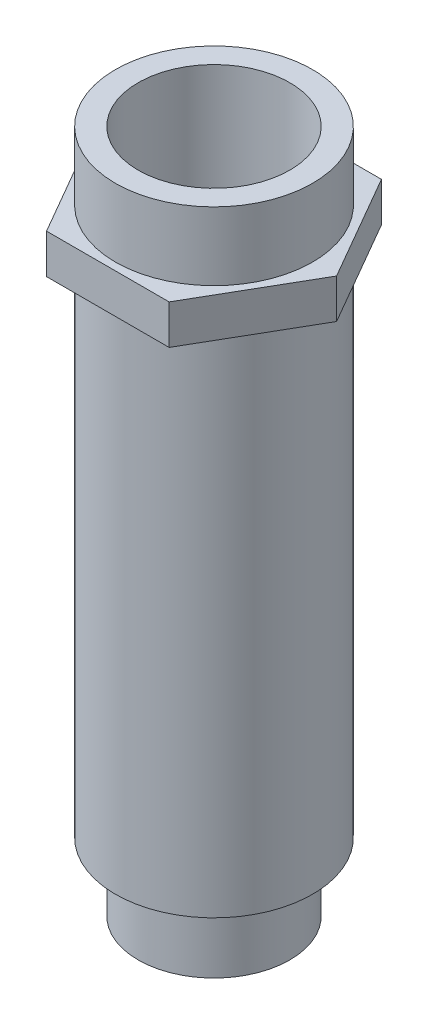
ISO-10303-21;
HEADER;
FILE_DESCRIPTION(('STEP AP214'),'2;1');
FILE_NAME('part.step','',(''),(''),'','','');
FILE_SCHEMA(('AUTOMOTIVE_DESIGN { 1 0 10303 214 1 1 1 1 }'));
ENDSEC;
DATA;
#1=APPLICATION_CONTEXT('core data for automotive mechanical design processes');
#2=APPLICATION_PROTOCOL_DEFINITION('international standard','automotive_design',2000,#1);
#3=PRODUCT_CONTEXT('',#1,'mechanical');
#4=PRODUCT('Part','Part','',(#3));
#5=PRODUCT_RELATED_PRODUCT_CATEGORY('part','',(#4));
#6=PRODUCT_DEFINITION_FORMATION('','',#4);
#7=PRODUCT_DEFINITION_CONTEXT('part definition',#1,'design');
#8=PRODUCT_DEFINITION('design','',#6,#7);
#9=PRODUCT_DEFINITION_SHAPE('','',#8);
#10=(LENGTH_UNIT() NAMED_UNIT(*) SI_UNIT(.MILLI.,.METRE.));
#11=(NAMED_UNIT(*) PLANE_ANGLE_UNIT() SI_UNIT($,.RADIAN.));
#12=(NAMED_UNIT(*) SI_UNIT($,.STERADIAN.) SOLID_ANGLE_UNIT());
#13=UNCERTAINTY_MEASURE_WITH_UNIT(LENGTH_MEASURE(1.E-05),#10,'distance_accuracy_value','');
#14=(GEOMETRIC_REPRESENTATION_CONTEXT(3) GLOBAL_UNCERTAINTY_ASSIGNED_CONTEXT((#13)) GLOBAL_UNIT_ASSIGNED_CONTEXT((#10,
#11,#12)) REPRESENTATION_CONTEXT('',''));
#15=CARTESIAN_POINT('',(0.,0.,0.));
#16=DIRECTION('',(0.,0.,1.));
#17=DIRECTION('',(1.,0.,0.));
#18=AXIS2_PLACEMENT_3D('',#15,#16,#17);
#19=CARTESIAN_POINT('',(6.5,0.,0.));
#20=DIRECTION('',(0.,1.,0.));
#21=DIRECTION('',(-1.,0.,0.));
#22=AXIS2_PLACEMENT_3D('',#19,#20,#21);
#23=PLANE('',#22);
#24=CARTESIAN_POINT('',(0.,0.,0.));
#25=DIRECTION('',(0.,1.,0.));
#26=DIRECTION('',(-1.,0.,0.));
#27=AXIS2_PLACEMENT_3D('',#24,#25,#26);
#28=CIRCLE('',#27,6.5);
#29=CARTESIAN_POINT('',(-6.5,0.,0.));
#30=VERTEX_POINT('',#29);
#31=EDGE_CURVE('E126',#30,#30,#28,.T.);
#32=ORIENTED_EDGE('',*,*,#31,.F.);
#33=EDGE_LOOP('',(#32));
#34=FACE_BOUND('',#33,.T.);
#35=CARTESIAN_POINT('',(0.,0.,0.));
#36=DIRECTION('',(0.,1.,0.));
#37=DIRECTION('',(-1.,0.,0.));
#38=AXIS2_PLACEMENT_3D('',#35,#36,#37);
#39=CIRCLE('',#38,5.);
#40=CARTESIAN_POINT('',(-5.,0.,0.));
#41=VERTEX_POINT('',#40);
#42=EDGE_CURVE('E12',#41,#41,#39,.F.);
#43=ORIENTED_EDGE('',*,*,#42,.F.);
#44=EDGE_LOOP('',(#43));
#45=FACE_BOUND('',#44,.T.);
#46=ADVANCED_FACE('F18',(#34,#45),#23,.F.);
#47=CARTESIAN_POINT('',(8.08290376865476,36.1,0.));
#48=DIRECTION('',(0.,1.,0.));
#49=DIRECTION('',(0.,0.,1.));
#50=AXIS2_PLACEMENT_3D('',#47,#48,#49);
#51=PLANE('',#50);
#52=DIRECTION('',(0.5,0.,-0.866025403784439));
#53=VECTOR('',#52,1.);
#54=CARTESIAN_POINT('',(4.04145188432738,36.1,7.));
#55=LINE('',#54,#53);
#56=CARTESIAN_POINT('',(4.04145188432738,36.1,7.));
#57=VERTEX_POINT('',#56);
#58=CARTESIAN_POINT('',(8.08290376865476,36.1,0.));
#59=VERTEX_POINT('',#58);
#60=EDGE_CURVE('E117',#57,#59,#55,.T.);
#61=ORIENTED_EDGE('',*,*,#60,.T.);
#62=DIRECTION('',(-0.5,0.,-0.866025403784439));
#63=VECTOR('',#62,1.);
#64=CARTESIAN_POINT('',(8.08290376865476,36.1,0.));
#65=LINE('',#64,#63);
#66=CARTESIAN_POINT('',(4.04145188432737,36.1,-7.));
#67=VERTEX_POINT('',#66);
#68=EDGE_CURVE('E74',#59,#67,#65,.T.);
#69=ORIENTED_EDGE('',*,*,#68,.T.);
#70=DIRECTION('',(-1.,0.,0.));
#71=VECTOR('',#70,1.);
#72=CARTESIAN_POINT('',(4.04145188432737,36.1,-7.));
#73=LINE('',#72,#71);
#74=CARTESIAN_POINT('',(-4.04145188432739,36.1,-7.));
#75=VERTEX_POINT('',#74);
#76=EDGE_CURVE('E88',#67,#75,#73,.T.);
#77=ORIENTED_EDGE('',*,*,#76,.T.);
#78=DIRECTION('',(-0.5,0.,0.866025403784439));
#79=VECTOR('',#78,1.);
#80=CARTESIAN_POINT('',(-4.04145188432739,36.1,-7.));
#81=LINE('',#80,#79);
#82=CARTESIAN_POINT('',(-8.08290376865477,36.1,0.));
#83=VERTEX_POINT('',#82);
#84=EDGE_CURVE('E81',#75,#83,#81,.T.);
#85=ORIENTED_EDGE('',*,*,#84,.T.);
#86=DIRECTION('',(0.5,0.,0.866025403784439));
#87=VECTOR('',#86,1.);
#88=CARTESIAN_POINT('',(-8.08290376865477,36.1,0.));
#89=LINE('',#88,#87);
#90=CARTESIAN_POINT('',(-4.04145188432739,36.1,7.));
#91=VERTEX_POINT('',#90);
#92=EDGE_CURVE('E86',#83,#91,#89,.T.);
#93=ORIENTED_EDGE('',*,*,#92,.T.);
#94=DIRECTION('',(1.,0.,0.));
#95=VECTOR('',#94,1.);
#96=CARTESIAN_POINT('',(-4.04145188432739,36.1,7.));
#97=LINE('',#96,#95);
#98=EDGE_CURVE('E36',#91,#57,#97,.T.);
#99=ORIENTED_EDGE('',*,*,#98,.T.);
#100=EDGE_LOOP('',(#61,#69,#77,#85,#93,#99));
#101=FACE_BOUND('',#100,.T.);
#102=CARTESIAN_POINT('',(0.,36.1,0.));
#103=DIRECTION('',(0.,1.,0.));
#104=DIRECTION('',(0.,0.,1.));
#105=AXIS2_PLACEMENT_3D('',#102,#103,#104);
#106=CIRCLE('',#105,6.5);
#107=CARTESIAN_POINT('',(0.,36.1,6.5));
#108=VERTEX_POINT('',#107);
#109=EDGE_CURVE('E196',#108,#108,#106,.T.);
#110=ORIENTED_EDGE('',*,*,#109,.F.);
#111=EDGE_LOOP('',(#110));
#112=FACE_BOUND('',#111,.T.);
#113=ADVANCED_FACE('F83',(#101,#112),#51,.T.);
#114=CARTESIAN_POINT('',(0.,33.5,0.));
#115=DIRECTION('',(0.,1.,0.));
#116=DIRECTION('',(-1.,0.,0.));
#117=AXIS2_PLACEMENT_3D('',#114,#115,#116);
#118=CYLINDRICAL_SURFACE('',#117,6.5);
#119=CARTESIAN_POINT('',(0.,33.5,0.));
#120=DIRECTION('',(0.,1.,0.));
#121=DIRECTION('',(-1.,0.,0.));
#122=AXIS2_PLACEMENT_3D('',#119,#120,#121);
#123=CIRCLE('',#122,6.5);
#124=CARTESIAN_POINT('',(-6.50000000000001,33.5,0.));
#125=VERTEX_POINT('',#124);
#126=EDGE_CURVE('E28',#125,#125,#123,.T.);
#127=ORIENTED_EDGE('',*,*,#126,.F.);
#128=EDGE_LOOP('',(#127));
#129=FACE_BOUND('',#128,.T.);
#130=ORIENTED_EDGE('',*,*,#31,.T.);
#131=EDGE_LOOP('',(#130));
#132=FACE_BOUND('',#131,.T.);
#133=ADVANCED_FACE('F20',(#129,#132),#118,.T.);
#134=CARTESIAN_POINT('',(8.08290376865476,33.5,0.));
#135=DIRECTION('',(0.,1.,0.));
#136=DIRECTION('',(0.,0.,1.));
#137=AXIS2_PLACEMENT_3D('',#134,#135,#136);
#138=PLANE('',#137);
#139=DIRECTION('',(0.5,0.,-0.866025403784439));
#140=VECTOR('',#139,1.);
#141=CARTESIAN_POINT('',(4.04145188432738,33.5,7.));
#142=LINE('',#141,#140);
#143=CARTESIAN_POINT('',(4.04145188432738,33.5,7.));
#144=VERTEX_POINT('',#143);
#145=CARTESIAN_POINT('',(8.08290376865476,33.5,0.));
#146=VERTEX_POINT('',#145);
#147=EDGE_CURVE('E106',#144,#146,#142,.T.);
#148=ORIENTED_EDGE('',*,*,#147,.F.);
#149=DIRECTION('',(1.,0.,0.));
#150=VECTOR('',#149,1.);
#151=CARTESIAN_POINT('',(-4.04145188432739,33.5,7.));
#152=LINE('',#151,#150);
#153=CARTESIAN_POINT('',(-4.04145188432739,33.5,7.));
#154=VERTEX_POINT('',#153);
#155=EDGE_CURVE('E65',#154,#144,#152,.T.);
#156=ORIENTED_EDGE('',*,*,#155,.F.);
#157=DIRECTION('',(0.5,0.,0.866025403784439));
#158=VECTOR('',#157,1.);
#159=CARTESIAN_POINT('',(-8.08290376865477,33.5,0.));
#160=LINE('',#159,#158);
#161=CARTESIAN_POINT('',(-8.08290376865477,33.5,0.));
#162=VERTEX_POINT('',#161);
#163=EDGE_CURVE('E59',#162,#154,#160,.T.);
#164=ORIENTED_EDGE('',*,*,#163,.F.);
#165=DIRECTION('',(-0.5,0.,0.866025403784439));
#166=VECTOR('',#165,1.);
#167=CARTESIAN_POINT('',(-4.04145188432739,33.5,-7.));
#168=LINE('',#167,#166);
#169=CARTESIAN_POINT('',(-4.04145188432739,33.5,-7.));
#170=VERTEX_POINT('',#169);
#171=EDGE_CURVE('E96',#170,#162,#168,.T.);
#172=ORIENTED_EDGE('',*,*,#171,.F.);
#173=DIRECTION('',(-1.,0.,0.));
#174=VECTOR('',#173,1.);
#175=CARTESIAN_POINT('',(4.04145188432737,33.5,-7.));
#176=LINE('',#175,#174);
#177=CARTESIAN_POINT('',(4.04145188432737,33.5,-7.));
#178=VERTEX_POINT('',#177);
#179=EDGE_CURVE('E112',#178,#170,#176,.T.);
#180=ORIENTED_EDGE('',*,*,#179,.F.);
#181=DIRECTION('',(-0.5,0.,-0.866025403784439));
#182=VECTOR('',#181,1.);
#183=CARTESIAN_POINT('',(8.08290376865476,33.5,0.));
#184=LINE('',#183,#182);
#185=EDGE_CURVE('E109',#146,#178,#184,.T.);
#186=ORIENTED_EDGE('',*,*,#185,.F.);
#187=EDGE_LOOP('',(#148,#156,#164,#172,#180,#186));
#188=FACE_BOUND('',#187,.T.);
#189=ORIENTED_EDGE('',*,*,#126,.T.);
#190=EDGE_LOOP('',(#189));
#191=FACE_BOUND('',#190,.T.);
#192=ADVANCED_FACE('F132',(#188,#191),#138,.F.);
#193=CARTESIAN_POINT('',(4.04145188432738,36.1,7.));
#194=DIRECTION('',(-0.866025403784439,0.,-0.5));
#195=DIRECTION('',(-0.5,0.,0.866025403784439));
#196=AXIS2_PLACEMENT_3D('',#193,#194,#195);
#197=PLANE('',#196);
#198=ORIENTED_EDGE('',*,*,#147,.T.);
#199=DIRECTION('',(0.,-1.,0.));
#200=VECTOR('',#199,1.);
#201=CARTESIAN_POINT('',(8.08290376865476,36.1,0.));
#202=LINE('',#201,#200);
#203=EDGE_CURVE('E124',#59,#146,#202,.T.);
#204=ORIENTED_EDGE('',*,*,#203,.F.);
#205=ORIENTED_EDGE('',*,*,#60,.F.);
#206=DIRECTION('',(0.,-1.,0.));
#207=VECTOR('',#206,1.);
#208=CARTESIAN_POINT('',(4.04145188432738,36.1,7.));
#209=LINE('',#208,#207);
#210=EDGE_CURVE('E102',#57,#144,#209,.T.);
#211=ORIENTED_EDGE('',*,*,#210,.T.);
#212=EDGE_LOOP('',(#198,#204,#205,#211));
#213=FACE_BOUND('',#212,.T.);
#214=ADVANCED_FACE('F170',(#213),#197,.F.);
#215=CARTESIAN_POINT('',(8.08290376865476,36.1,0.));
#216=DIRECTION('',(-0.866025403784439,0.,0.5));
#217=DIRECTION('',(0.5,0.,0.866025403784439));
#218=AXIS2_PLACEMENT_3D('',#215,#216,#217);
#219=PLANE('',#218);
#220=ORIENTED_EDGE('',*,*,#185,.T.);
#221=DIRECTION('',(0.,-1.,0.));
#222=VECTOR('',#221,1.);
#223=CARTESIAN_POINT('',(4.04145188432737,36.1,-7.));
#224=LINE('',#223,#222);
#225=EDGE_CURVE('E121',#67,#178,#224,.T.);
#226=ORIENTED_EDGE('',*,*,#225,.F.);
#227=ORIENTED_EDGE('',*,*,#68,.F.);
#228=ORIENTED_EDGE('',*,*,#203,.T.);
#229=EDGE_LOOP('',(#220,#226,#227,#228));
#230=FACE_BOUND('',#229,.T.);
#231=ADVANCED_FACE('F181',(#230),#219,.F.);
#232=CARTESIAN_POINT('',(4.04145188432737,36.1,-7.));
#233=DIRECTION('',(0.,0.,1.));
#234=DIRECTION('',(1.,0.,0.));
#235=AXIS2_PLACEMENT_3D('',#232,#233,#234);
#236=PLANE('',#235);
#237=ORIENTED_EDGE('',*,*,#179,.T.);
#238=DIRECTION('',(0.,-1.,0.));
#239=VECTOR('',#238,1.);
#240=CARTESIAN_POINT('',(-4.04145188432739,36.1,-7.));
#241=LINE('',#240,#239);
#242=EDGE_CURVE('E97',#75,#170,#241,.T.);
#243=ORIENTED_EDGE('',*,*,#242,.F.);
#244=ORIENTED_EDGE('',*,*,#76,.F.);
#245=ORIENTED_EDGE('',*,*,#225,.T.);
#246=EDGE_LOOP('',(#237,#243,#244,#245));
#247=FACE_BOUND('',#246,.T.);
#248=ADVANCED_FACE('F178',(#247),#236,.F.);
#249=CARTESIAN_POINT('',(-4.04145188432739,36.1,-7.));
#250=DIRECTION('',(0.866025403784439,0.,0.5));
#251=DIRECTION('',(0.5,0.,-0.866025403784439));
#252=AXIS2_PLACEMENT_3D('',#249,#250,#251);
#253=PLANE('',#252);
#254=ORIENTED_EDGE('',*,*,#171,.T.);
#255=DIRECTION('',(0.,-1.,0.));
#256=VECTOR('',#255,1.);
#257=CARTESIAN_POINT('',(-8.08290376865477,36.1,0.));
#258=LINE('',#257,#256);
#259=EDGE_CURVE('E93',#83,#162,#258,.T.);
#260=ORIENTED_EDGE('',*,*,#259,.F.);
#261=ORIENTED_EDGE('',*,*,#84,.F.);
#262=ORIENTED_EDGE('',*,*,#242,.T.);
#263=EDGE_LOOP('',(#254,#260,#261,#262));
#264=FACE_BOUND('',#263,.T.);
#265=ADVANCED_FACE('F94',(#264),#253,.F.);
#266=CARTESIAN_POINT('',(-8.08290376865477,36.1,0.));
#267=DIRECTION('',(0.866025403784439,0.,-0.5));
#268=DIRECTION('',(-0.5,0.,-0.866025403784439));
#269=AXIS2_PLACEMENT_3D('',#266,#267,#268);
#270=PLANE('',#269);
#271=ORIENTED_EDGE('',*,*,#163,.T.);
#272=DIRECTION('',(0.,-1.,0.));
#273=VECTOR('',#272,1.);
#274=CARTESIAN_POINT('',(-4.04145188432739,36.1,7.));
#275=LINE('',#274,#273);
#276=EDGE_CURVE('E98',#91,#154,#275,.T.);
#277=ORIENTED_EDGE('',*,*,#276,.F.);
#278=ORIENTED_EDGE('',*,*,#92,.F.);
#279=ORIENTED_EDGE('',*,*,#259,.T.);
#280=EDGE_LOOP('',(#271,#277,#278,#279));
#281=FACE_BOUND('',#280,.T.);
#282=ADVANCED_FACE('F100',(#281),#270,.F.);
#283=CARTESIAN_POINT('',(-4.04145188432739,36.1,7.));
#284=DIRECTION('',(0.,0.,-1.));
#285=DIRECTION('',(-1.,0.,0.));
#286=AXIS2_PLACEMENT_3D('',#283,#284,#285);
#287=PLANE('',#286);
#288=ORIENTED_EDGE('',*,*,#155,.T.);
#289=ORIENTED_EDGE('',*,*,#210,.F.);
#290=ORIENTED_EDGE('',*,*,#98,.F.);
#291=ORIENTED_EDGE('',*,*,#276,.T.);
#292=EDGE_LOOP('',(#288,#289,#290,#291));
#293=FACE_BOUND('',#292,.T.);
#294=ADVANCED_FACE('F164',(#293),#287,.F.);
#295=CARTESIAN_POINT('',(0.,40.6,0.));
#296=DIRECTION('',(0.,-1.,0.));
#297=DIRECTION('',(0.,0.,-1.));
#298=AXIS2_PLACEMENT_3D('',#295,#296,#297);
#299=CYLINDRICAL_SURFACE('',#298,6.5);
#300=CARTESIAN_POINT('',(0.,40.6,0.));
#301=DIRECTION('',(0.,1.,0.));
#302=DIRECTION('',(0.,0.,1.));
#303=AXIS2_PLACEMENT_3D('',#300,#301,#302);
#304=CIRCLE('',#303,6.5);
#305=CARTESIAN_POINT('',(0.,40.6,6.5));
#306=VERTEX_POINT('',#305);
#307=EDGE_CURVE('E110',#306,#306,#304,.T.);
#308=ORIENTED_EDGE('',*,*,#307,.F.);
#309=EDGE_LOOP('',(#308));
#310=FACE_BOUND('',#309,.T.);
#311=ORIENTED_EDGE('',*,*,#109,.T.);
#312=EDGE_LOOP('',(#311));
#313=FACE_BOUND('',#312,.T.);
#314=ADVANCED_FACE('F156',(#310,#313),#299,.T.);
#315=CARTESIAN_POINT('',(0.,40.6,0.));
#316=DIRECTION('',(0.,1.,0.));
#317=DIRECTION('',(0.,0.,1.));
#318=AXIS2_PLACEMENT_3D('',#315,#316,#317);
#319=PLANE('',#318);
#320=CARTESIAN_POINT('',(0.,40.6,0.));
#321=DIRECTION('',(0.,1.,0.));
#322=DIRECTION('',(0.,0.,1.));
#323=AXIS2_PLACEMENT_3D('',#320,#321,#322);
#324=CIRCLE('',#323,5.);
#325=CARTESIAN_POINT('',(0.,40.6,5.));
#326=VERTEX_POINT('',#325);
#327=EDGE_CURVE('E213',#326,#326,#324,.T.);
#328=ORIENTED_EDGE('',*,*,#327,.F.);
#329=EDGE_LOOP('',(#328));
#330=FACE_BOUND('',#329,.T.);
#331=ORIENTED_EDGE('',*,*,#307,.T.);
#332=EDGE_LOOP('',(#331));
#333=FACE_BOUND('',#332,.T.);
#334=ADVANCED_FACE('F145',(#330,#333),#319,.T.);
#335=CARTESIAN_POINT('',(0.,-4.5,0.));
#336=DIRECTION('',(0.,1.,0.));
#337=DIRECTION('',(-1.,0.,0.));
#338=AXIS2_PLACEMENT_3D('',#335,#336,#337);
#339=CYLINDRICAL_SURFACE('',#338,5.);
#340=CARTESIAN_POINT('',(0.,-4.5,0.));
#341=DIRECTION('',(0.,-1.,0.));
#342=DIRECTION('',(1.,0.,0.));
#343=AXIS2_PLACEMENT_3D('',#340,#341,#342);
#344=CIRCLE('',#343,5.);
#345=CARTESIAN_POINT('',(5.,-4.5,0.));
#346=VERTEX_POINT('',#345);
#347=EDGE_CURVE('E199',#346,#346,#344,.T.);
#348=ORIENTED_EDGE('',*,*,#347,.F.);
#349=EDGE_LOOP('',(#348));
#350=FACE_BOUND('',#349,.T.);
#351=ORIENTED_EDGE('',*,*,#42,.T.);
#352=EDGE_LOOP('',(#351));
#353=FACE_BOUND('',#352,.T.);
#354=ADVANCED_FACE('F142',(#350,#353),#339,.T.);
#355=CARTESIAN_POINT('',(0.,-4.5,0.));
#356=DIRECTION('',(0.,-1.,0.));
#357=DIRECTION('',(1.,0.,0.));
#358=AXIS2_PLACEMENT_3D('',#355,#356,#357);
#359=PLANE('',#358);
#360=CARTESIAN_POINT('',(0.,-4.5,0.));
#361=DIRECTION('',(0.,-1.,0.));
#362=DIRECTION('',(1.,0.,0.));
#363=AXIS2_PLACEMENT_3D('',#360,#361,#362);
#364=CIRCLE('',#363,3.);
#365=CARTESIAN_POINT('',(3.,-4.5,0.));
#366=VERTEX_POINT('',#365);
#367=EDGE_CURVE('E205',#366,#366,#364,.T.);
#368=ORIENTED_EDGE('',*,*,#367,.F.);
#369=EDGE_LOOP('',(#368));
#370=FACE_BOUND('',#369,.T.);
#371=ORIENTED_EDGE('',*,*,#347,.T.);
#372=EDGE_LOOP('',(#371));
#373=FACE_BOUND('',#372,.T.);
#374=ADVANCED_FACE('F144',(#370,#373),#359,.T.);
#375=CARTESIAN_POINT('',(0.,-3.,0.));
#376=DIRECTION('',(0.,-1.,0.));
#377=DIRECTION('',(1.,0.,0.));
#378=AXIS2_PLACEMENT_3D('',#375,#376,#377);
#379=CYLINDRICAL_SURFACE('',#378,3.);
#380=CARTESIAN_POINT('',(0.,-3.,0.));
#381=DIRECTION('',(0.,-1.,0.));
#382=DIRECTION('',(1.,0.,0.));
#383=AXIS2_PLACEMENT_3D('',#380,#381,#382);
#384=CIRCLE('',#383,3.);
#385=CARTESIAN_POINT('',(3.,-3.,0.));
#386=VERTEX_POINT('',#385);
#387=EDGE_CURVE('E204',#386,#386,#384,.T.);
#388=ORIENTED_EDGE('',*,*,#387,.F.);
#389=EDGE_LOOP('',(#388));
#390=FACE_BOUND('',#389,.T.);
#391=ORIENTED_EDGE('',*,*,#367,.T.);
#392=EDGE_LOOP('',(#391));
#393=FACE_BOUND('',#392,.T.);
#394=ADVANCED_FACE('F153',(#390,#393),#379,.F.);
#395=CARTESIAN_POINT('',(0.,-3.,0.));
#396=DIRECTION('',(0.,-1.,0.));
#397=DIRECTION('',(1.,0.,0.));
#398=AXIS2_PLACEMENT_3D('',#395,#396,#397);
#399=PLANE('',#398);
#400=CARTESIAN_POINT('',(0.,-3.,0.));
#401=DIRECTION('',(0.,-1.,0.));
#402=DIRECTION('',(0.,0.,-1.));
#403=AXIS2_PLACEMENT_3D('',#400,#401,#402);
#404=CIRCLE('',#403,1.5);
#405=CARTESIAN_POINT('',(0.,-3.,-1.5));
#406=VERTEX_POINT('',#405);
#407=EDGE_CURVE('E222',#406,#406,#404,.T.);
#408=ORIENTED_EDGE('',*,*,#407,.F.);
#409=EDGE_LOOP('',(#408));
#410=FACE_BOUND('',#409,.T.);
#411=ORIENTED_EDGE('',*,*,#387,.T.);
#412=EDGE_LOOP('',(#411));
#413=FACE_BOUND('',#412,.T.);
#414=ADVANCED_FACE('F247',(#410,#413),#399,.T.);
#415=CARTESIAN_POINT('',(0.,2.6,0.));
#416=DIRECTION('',(0.,-1.,0.));
#417=DIRECTION('',(1.,0.,0.));
#418=AXIS2_PLACEMENT_3D('',#415,#416,#417);
#419=PLANE('',#418);
#420=CARTESIAN_POINT('',(0.,2.6,0.));
#421=DIRECTION('',(0.,1.,0.));
#422=DIRECTION('',(-1.,0.,0.));
#423=AXIS2_PLACEMENT_3D('',#420,#421,#422);
#424=CIRCLE('',#423,3.);
#425=CARTESIAN_POINT('',(-3.,2.6,0.));
#426=VERTEX_POINT('',#425);
#427=EDGE_CURVE('E217',#426,#426,#424,.T.);
#428=ORIENTED_EDGE('',*,*,#427,.F.);
#429=EDGE_LOOP('',(#428));
#430=FACE_BOUND('',#429,.T.);
#431=CARTESIAN_POINT('',(0.,2.6,0.));
#432=DIRECTION('',(0.,-1.,0.));
#433=DIRECTION('',(1.,0.,0.));
#434=AXIS2_PLACEMENT_3D('',#431,#432,#433);
#435=CIRCLE('',#434,5.);
#436=CARTESIAN_POINT('',(5.,2.6,0.));
#437=VERTEX_POINT('',#436);
#438=EDGE_CURVE('E208',#437,#437,#435,.F.);
#439=ORIENTED_EDGE('',*,*,#438,.T.);
#440=EDGE_LOOP('',(#439));
#441=FACE_BOUND('',#440,.T.);
#442=ADVANCED_FACE('F244',(#430,#441),#419,.F.);
#443=CARTESIAN_POINT('',(0.,-18.642135623731,0.));
#444=DIRECTION('',(0.,1.,0.));
#445=DIRECTION('',(0.,0.,1.));
#446=AXIS2_PLACEMENT_3D('',#443,#444,#445);
#447=CYLINDRICAL_SURFACE('',#446,5.);
#448=ORIENTED_EDGE('',*,*,#327,.T.);
#449=EDGE_LOOP('',(#448));
#450=FACE_BOUND('',#449,.T.);
#451=ORIENTED_EDGE('',*,*,#438,.F.);
#452=EDGE_LOOP('',(#451));
#453=FACE_BOUND('',#452,.T.);
#454=ADVANCED_FACE('F240',(#450,#453),#447,.F.);
#455=CARTESIAN_POINT('',(0.,1.1,0.));
#456=DIRECTION('',(0.,1.,0.));
#457=DIRECTION('',(-1.,0.,0.));
#458=AXIS2_PLACEMENT_3D('',#455,#456,#457);
#459=CYLINDRICAL_SURFACE('',#458,3.);
#460=CARTESIAN_POINT('',(0.,1.1,0.));
#461=DIRECTION('',(0.,1.,0.));
#462=DIRECTION('',(-1.,0.,0.));
#463=AXIS2_PLACEMENT_3D('',#460,#461,#462);
#464=CIRCLE('',#463,3.);
#465=CARTESIAN_POINT('',(-3.,1.1,0.));
#466=VERTEX_POINT('',#465);
#467=EDGE_CURVE('E216',#466,#466,#464,.T.);
#468=ORIENTED_EDGE('',*,*,#467,.F.);
#469=EDGE_LOOP('',(#468));
#470=FACE_BOUND('',#469,.T.);
#471=ORIENTED_EDGE('',*,*,#427,.T.);
#472=EDGE_LOOP('',(#471));
#473=FACE_BOUND('',#472,.T.);
#474=ADVANCED_FACE('F234',(#470,#473),#459,.F.);
#475=CARTESIAN_POINT('',(0.,1.1,0.));
#476=DIRECTION('',(0.,1.,0.));
#477=DIRECTION('',(-1.,0.,0.));
#478=AXIS2_PLACEMENT_3D('',#475,#476,#477);
#479=PLANE('',#478);
#480=CARTESIAN_POINT('',(0.,1.1,0.));
#481=DIRECTION('',(0.,1.,0.));
#482=DIRECTION('',(-1.,0.,0.));
#483=AXIS2_PLACEMENT_3D('',#480,#481,#482);
#484=CIRCLE('',#483,1.49999999999999);
#485=CARTESIAN_POINT('',(-1.49999999999999,1.1,0.));
#486=VERTEX_POINT('',#485);
#487=EDGE_CURVE('E22',#486,#486,#484,.T.);
#488=ORIENTED_EDGE('',*,*,#487,.F.);
#489=EDGE_LOOP('',(#488));
#490=FACE_BOUND('',#489,.T.);
#491=ORIENTED_EDGE('',*,*,#467,.T.);
#492=EDGE_LOOP('',(#491));
#493=FACE_BOUND('',#492,.T.);
#494=ADVANCED_FACE('F231',(#490,#493),#479,.T.);
#495=CARTESIAN_POINT('',(0.,-3.,0.));
#496=DIRECTION('',(0.,-1.,0.));
#497=DIRECTION('',(0.,0.,-1.));
#498=AXIS2_PLACEMENT_3D('',#495,#496,#497);
#499=CYLINDRICAL_SURFACE('',#498,1.49999999999999);
#500=ORIENTED_EDGE('',*,*,#487,.T.);
#501=EDGE_LOOP('',(#500));
#502=FACE_BOUND('',#501,.T.);
#503=ORIENTED_EDGE('',*,*,#407,.T.);
#504=EDGE_LOOP('',(#503));
#505=FACE_BOUND('',#504,.T.);
#506=ADVANCED_FACE('F229',(#502,#505),#499,.F.);
#507=CLOSED_SHELL('',(#46,#113,#133,#192,#214,#231,#248,#265,#282,#294,#314,#334,#354,#374,#394,
#414,#442,#454,#474,#494,#506));
#508=MANIFOLD_SOLID_BREP('B1',#507);
#509=ADVANCED_BREP_SHAPE_REPRESENTATION('',(#18,#508),#14);
#510=SHAPE_DEFINITION_REPRESENTATION(#9,#509);
ENDSEC;
END-ISO-10303-21;
